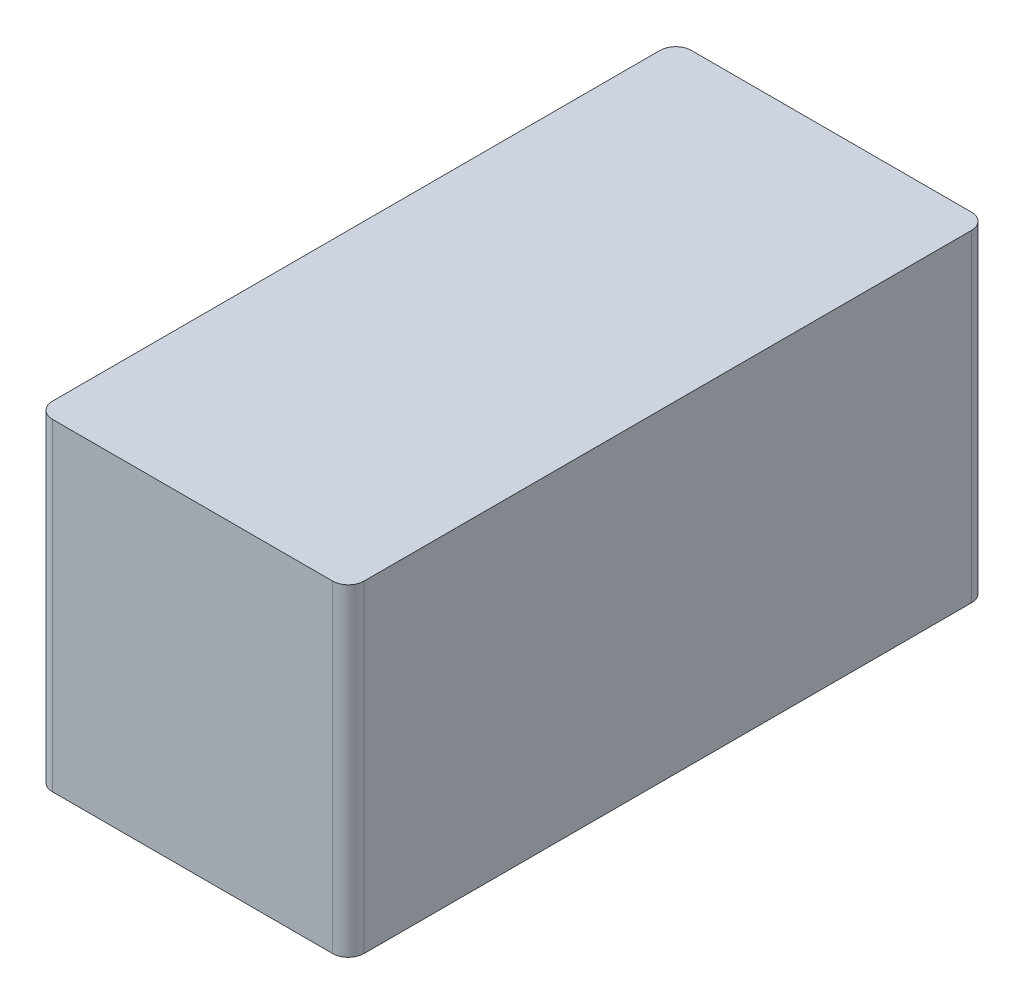
ISO-10303-21;
HEADER;
FILE_DESCRIPTION(('STEP AP214'),'2;1');
FILE_NAME('part.step','',(''),(''),'','','');
FILE_SCHEMA(('AUTOMOTIVE_DESIGN { 1 0 10303 214 1 1 1 1 }'));
ENDSEC;
DATA;
#1=APPLICATION_CONTEXT('core data for automotive mechanical design processes');
#2=APPLICATION_PROTOCOL_DEFINITION('international standard','automotive_design',2000,#1);
#3=PRODUCT_CONTEXT('',#1,'mechanical');
#4=PRODUCT('Part','Part','',(#3));
#5=PRODUCT_RELATED_PRODUCT_CATEGORY('part','',(#4));
#6=PRODUCT_DEFINITION_FORMATION('','',#4);
#7=PRODUCT_DEFINITION_CONTEXT('part definition',#1,'design');
#8=PRODUCT_DEFINITION('design','',#6,#7);
#9=PRODUCT_DEFINITION_SHAPE('','',#8);
#10=(LENGTH_UNIT() NAMED_UNIT(*) SI_UNIT(.MILLI.,.METRE.));
#11=(NAMED_UNIT(*) PLANE_ANGLE_UNIT() SI_UNIT($,.RADIAN.));
#12=(NAMED_UNIT(*) SI_UNIT($,.STERADIAN.) SOLID_ANGLE_UNIT());
#13=UNCERTAINTY_MEASURE_WITH_UNIT(LENGTH_MEASURE(1.E-05),#10,'distance_accuracy_value','');
#14=(GEOMETRIC_REPRESENTATION_CONTEXT(3) GLOBAL_UNCERTAINTY_ASSIGNED_CONTEXT((#13)) GLOBAL_UNIT_ASSIGNED_CONTEXT((#10,
#11,#12)) REPRESENTATION_CONTEXT('',''));
#15=CARTESIAN_POINT('',(0.,0.,0.));
#16=DIRECTION('',(0.,0.,1.));
#17=DIRECTION('',(1.,0.,0.));
#18=AXIS2_PLACEMENT_3D('',#15,#16,#17);
#19=CARTESIAN_POINT('',(9.9,10.25,-20.3));
#20=DIRECTION('',(-1.,0.,0.));
#21=DIRECTION('',(0.,0.,1.));
#22=AXIS2_PLACEMENT_3D('',#19,#20,#21);
#23=PLANE('',#22);
#24=DIRECTION('',(0.,0.,-1.));
#25=VECTOR('',#24,1.);
#26=CARTESIAN_POINT('',(9.9,-10.25,-20.3));
#27=LINE('',#26,#25);
#28=CARTESIAN_POINT('',(9.9,-10.25,19.3));
#29=VERTEX_POINT('',#28);
#30=CARTESIAN_POINT('',(9.9,-10.25,-19.3));
#31=VERTEX_POINT('',#30);
#32=EDGE_CURVE('E128',#29,#31,#27,.T.);
#33=ORIENTED_EDGE('',*,*,#32,.T.);
#34=DIRECTION('',(0.,-1.,0.));
#35=VECTOR('',#34,1.);
#36=CARTESIAN_POINT('',(9.9,10.25,-19.3));
#37=LINE('',#36,#35);
#38=CARTESIAN_POINT('',(9.9,10.25,-19.3));
#39=VERTEX_POINT('',#38);
#40=EDGE_CURVE('E151',#31,#39,#37,.F.);
#41=ORIENTED_EDGE('',*,*,#40,.T.);
#42=DIRECTION('',(0.,0.,-1.));
#43=VECTOR('',#42,1.);
#44=CARTESIAN_POINT('',(9.9,10.25,-20.3));
#45=LINE('',#44,#43);
#46=CARTESIAN_POINT('',(9.9,10.25,19.3));
#47=VERTEX_POINT('',#46);
#48=EDGE_CURVE('E126',#47,#39,#45,.T.);
#49=ORIENTED_EDGE('',*,*,#48,.F.);
#50=DIRECTION('',(0.,-1.,0.));
#51=VECTOR('',#50,1.);
#52=CARTESIAN_POINT('',(9.9,10.25,19.3));
#53=LINE('',#52,#51);
#54=EDGE_CURVE('E148',#47,#29,#53,.T.);
#55=ORIENTED_EDGE('',*,*,#54,.T.);
#56=EDGE_LOOP('',(#33,#41,#49,#55));
#57=FACE_BOUND('',#56,.T.);
#58=ADVANCED_FACE('F33',(#57),#23,.F.);
#59=CARTESIAN_POINT('',(-9.9,10.25,-20.3));
#60=DIRECTION('',(0.,0.,1.));
#61=DIRECTION('',(1.,0.,0.));
#62=AXIS2_PLACEMENT_3D('',#59,#60,#61);
#63=PLANE('',#62);
#64=DIRECTION('',(-1.,0.,0.));
#65=VECTOR('',#64,1.);
#66=CARTESIAN_POINT('',(-9.9,-10.25,-20.3));
#67=LINE('',#66,#65);
#68=CARTESIAN_POINT('',(8.9,-10.25,-20.3));
#69=VERTEX_POINT('',#68);
#70=CARTESIAN_POINT('',(-8.9,-10.25,-20.3));
#71=VERTEX_POINT('',#70);
#72=EDGE_CURVE('E124',#69,#71,#67,.T.);
#73=ORIENTED_EDGE('',*,*,#72,.T.);
#74=DIRECTION('',(0.,-1.,0.));
#75=VECTOR('',#74,1.);
#76=CARTESIAN_POINT('',(-8.9,10.25,-20.3));
#77=LINE('',#76,#75);
#78=CARTESIAN_POINT('',(-8.9,10.25,-20.3));
#79=VERTEX_POINT('',#78);
#80=EDGE_CURVE('E103',#71,#79,#77,.F.);
#81=ORIENTED_EDGE('',*,*,#80,.T.);
#82=DIRECTION('',(-1.,0.,0.));
#83=VECTOR('',#82,1.);
#84=CARTESIAN_POINT('',(-9.9,10.25,-20.3));
#85=LINE('',#84,#83);
#86=CARTESIAN_POINT('',(8.9,10.25,-20.3));
#87=VERTEX_POINT('',#86);
#88=EDGE_CURVE('E167',#87,#79,#85,.T.);
#89=ORIENTED_EDGE('',*,*,#88,.F.);
#90=DIRECTION('',(0.,-1.,0.));
#91=VECTOR('',#90,1.);
#92=CARTESIAN_POINT('',(8.9,10.25,-20.3));
#93=LINE('',#92,#91);
#94=EDGE_CURVE('E108',#87,#69,#93,.T.);
#95=ORIENTED_EDGE('',*,*,#94,.T.);
#96=EDGE_LOOP('',(#73,#81,#89,#95));
#97=FACE_BOUND('',#96,.T.);
#98=ADVANCED_FACE('F184',(#97),#63,.F.);
#99=CARTESIAN_POINT('',(-9.9,10.25,-20.3));
#100=DIRECTION('',(1.,0.,0.));
#101=DIRECTION('',(0.,0.,-1.));
#102=AXIS2_PLACEMENT_3D('',#99,#100,#101);
#103=PLANE('',#102);
#104=DIRECTION('',(0.,0.,1.));
#105=VECTOR('',#104,1.);
#106=CARTESIAN_POINT('',(-9.9,10.25,-20.3));
#107=LINE('',#106,#105);
#108=CARTESIAN_POINT('',(-9.9,10.25,-19.3));
#109=VERTEX_POINT('',#108);
#110=CARTESIAN_POINT('',(-9.9,10.25,19.3));
#111=VERTEX_POINT('',#110);
#112=EDGE_CURVE('E117',#109,#111,#107,.T.);
#113=ORIENTED_EDGE('',*,*,#112,.F.);
#114=DIRECTION('',(0.,-1.,0.));
#115=VECTOR('',#114,1.);
#116=CARTESIAN_POINT('',(-9.9,10.25,-19.3));
#117=LINE('',#116,#115);
#118=CARTESIAN_POINT('',(-9.9,-10.25,-19.3));
#119=VERTEX_POINT('',#118);
#120=EDGE_CURVE('E102',#109,#119,#117,.T.);
#121=ORIENTED_EDGE('',*,*,#120,.T.);
#122=DIRECTION('',(0.,0.,1.));
#123=VECTOR('',#122,1.);
#124=CARTESIAN_POINT('',(-9.9,-10.25,-20.3));
#125=LINE('',#124,#123);
#126=CARTESIAN_POINT('',(-9.9,-10.25,19.3));
#127=VERTEX_POINT('',#126);
#128=EDGE_CURVE('E115',#119,#127,#125,.T.);
#129=ORIENTED_EDGE('',*,*,#128,.T.);
#130=DIRECTION('',(0.,-1.,0.));
#131=VECTOR('',#130,1.);
#132=CARTESIAN_POINT('',(-9.9,10.25,19.3));
#133=LINE('',#132,#131);
#134=EDGE_CURVE('E119',#127,#111,#133,.F.);
#135=ORIENTED_EDGE('',*,*,#134,.T.);
#136=EDGE_LOOP('',(#113,#121,#129,#135));
#137=FACE_BOUND('',#136,.T.);
#138=ADVANCED_FACE('F114',(#137),#103,.F.);
#139=CARTESIAN_POINT('',(-9.9,10.25,20.3));
#140=DIRECTION('',(0.,0.,-1.));
#141=DIRECTION('',(-1.,0.,0.));
#142=AXIS2_PLACEMENT_3D('',#139,#140,#141);
#143=PLANE('',#142);
#144=DIRECTION('',(1.,0.,0.));
#145=VECTOR('',#144,1.);
#146=CARTESIAN_POINT('',(-9.9,-10.25,20.3));
#147=LINE('',#146,#145);
#148=CARTESIAN_POINT('',(-8.9,-10.25,20.3));
#149=VERTEX_POINT('',#148);
#150=CARTESIAN_POINT('',(8.90000000000001,-10.25,20.3));
#151=VERTEX_POINT('',#150);
#152=EDGE_CURVE('E123',#149,#151,#147,.T.);
#153=ORIENTED_EDGE('',*,*,#152,.T.);
#154=DIRECTION('',(0.,-1.,0.));
#155=VECTOR('',#154,1.);
#156=CARTESIAN_POINT('',(8.90000000000001,10.25,20.3));
#157=LINE('',#156,#155);
#158=CARTESIAN_POINT('',(8.90000000000001,10.25,20.3));
#159=VERTEX_POINT('',#158);
#160=EDGE_CURVE('E11',#151,#159,#157,.F.);
#161=ORIENTED_EDGE('',*,*,#160,.T.);
#162=DIRECTION('',(1.,0.,0.));
#163=VECTOR('',#162,1.);
#164=CARTESIAN_POINT('',(-9.9,10.25,20.3));
#165=LINE('',#164,#163);
#166=CARTESIAN_POINT('',(-8.9,10.25,20.3));
#167=VERTEX_POINT('',#166);
#168=EDGE_CURVE('E132',#167,#159,#165,.T.);
#169=ORIENTED_EDGE('',*,*,#168,.F.);
#170=DIRECTION('',(0.,-1.,0.));
#171=VECTOR('',#170,1.);
#172=CARTESIAN_POINT('',(-8.9,10.25,20.3));
#173=LINE('',#172,#171);
#174=EDGE_CURVE('E41',#167,#149,#173,.T.);
#175=ORIENTED_EDGE('',*,*,#174,.T.);
#176=EDGE_LOOP('',(#153,#161,#169,#175));
#177=FACE_BOUND('',#176,.T.);
#178=ADVANCED_FACE('F154',(#177),#143,.F.);
#179=CARTESIAN_POINT('',(0.,10.25,0.));
#180=DIRECTION('',(0.,1.,0.));
#181=DIRECTION('',(0.,0.,1.));
#182=AXIS2_PLACEMENT_3D('',#179,#180,#181);
#183=PLANE('',#182);
#184=ORIENTED_EDGE('',*,*,#88,.T.);
#185=CARTESIAN_POINT('',(-8.9,10.25,-19.3));
#186=DIRECTION('',(0.,1.,0.));
#187=DIRECTION('',(0.,0.,1.));
#188=AXIS2_PLACEMENT_3D('',#185,#186,#187);
#189=CIRCLE('',#188,1.);
#190=EDGE_CURVE('E146',#79,#109,#189,.T.);
#191=ORIENTED_EDGE('',*,*,#190,.T.);
#192=ORIENTED_EDGE('',*,*,#112,.T.);
#193=CARTESIAN_POINT('',(-8.9,10.25,19.3));
#194=DIRECTION('',(0.,1.,0.));
#195=DIRECTION('',(0.,0.,1.));
#196=AXIS2_PLACEMENT_3D('',#193,#194,#195);
#197=CIRCLE('',#196,1.);
#198=EDGE_CURVE('E53',#111,#167,#197,.T.);
#199=ORIENTED_EDGE('',*,*,#198,.T.);
#200=ORIENTED_EDGE('',*,*,#168,.T.);
#201=CARTESIAN_POINT('',(8.90000000000001,10.25,19.3));
#202=DIRECTION('',(0.,1.,0.));
#203=DIRECTION('',(0.,0.,1.));
#204=AXIS2_PLACEMENT_3D('',#201,#202,#203);
#205=CIRCLE('',#204,1.);
#206=EDGE_CURVE('E142',#159,#47,#205,.T.);
#207=ORIENTED_EDGE('',*,*,#206,.T.);
#208=ORIENTED_EDGE('',*,*,#48,.T.);
#209=CARTESIAN_POINT('',(8.9,10.25,-19.3));
#210=DIRECTION('',(0.,1.,0.));
#211=DIRECTION('',(0.,0.,1.));
#212=AXIS2_PLACEMENT_3D('',#209,#210,#211);
#213=CIRCLE('',#212,1.);
#214=EDGE_CURVE('E144',#39,#87,#213,.T.);
#215=ORIENTED_EDGE('',*,*,#214,.T.);
#216=EDGE_LOOP('',(#184,#191,#192,#199,#200,#207,#208,#215));
#217=FACE_BOUND('',#216,.T.);
#218=ADVANCED_FACE('F173',(#217),#183,.T.);
#219=CARTESIAN_POINT('',(0.,-10.25,0.));
#220=DIRECTION('',(0.,1.,0.));
#221=DIRECTION('',(0.,0.,1.));
#222=AXIS2_PLACEMENT_3D('',#219,#220,#221);
#223=PLANE('',#222);
#224=ORIENTED_EDGE('',*,*,#128,.F.);
#225=CARTESIAN_POINT('',(-8.9,-10.25,-19.3));
#226=DIRECTION('',(0.,1.,0.));
#227=DIRECTION('',(0.,0.,1.));
#228=AXIS2_PLACEMENT_3D('',#225,#226,#227);
#229=CIRCLE('',#228,1.);
#230=EDGE_CURVE('E98',#119,#71,#229,.F.);
#231=ORIENTED_EDGE('',*,*,#230,.T.);
#232=ORIENTED_EDGE('',*,*,#72,.F.);
#233=CARTESIAN_POINT('',(8.9,-10.25,-19.3));
#234=DIRECTION('',(0.,1.,0.));
#235=DIRECTION('',(0.,0.,1.));
#236=AXIS2_PLACEMENT_3D('',#233,#234,#235);
#237=CIRCLE('',#236,1.);
#238=EDGE_CURVE('E109',#69,#31,#237,.F.);
#239=ORIENTED_EDGE('',*,*,#238,.T.);
#240=ORIENTED_EDGE('',*,*,#32,.F.);
#241=CARTESIAN_POINT('',(8.90000000000001,-10.25,19.3));
#242=DIRECTION('',(0.,1.,0.));
#243=DIRECTION('',(0.,0.,1.));
#244=AXIS2_PLACEMENT_3D('',#241,#242,#243);
#245=CIRCLE('',#244,1.);
#246=EDGE_CURVE('E135',#29,#151,#245,.F.);
#247=ORIENTED_EDGE('',*,*,#246,.T.);
#248=ORIENTED_EDGE('',*,*,#152,.F.);
#249=CARTESIAN_POINT('',(-8.9,-10.25,19.3));
#250=DIRECTION('',(0.,1.,0.));
#251=DIRECTION('',(0.,0.,1.));
#252=AXIS2_PLACEMENT_3D('',#249,#250,#251);
#253=CIRCLE('',#252,1.);
#254=EDGE_CURVE('E118',#149,#127,#253,.F.);
#255=ORIENTED_EDGE('',*,*,#254,.T.);
#256=EDGE_LOOP('',(#224,#231,#232,#239,#240,#247,#248,#255));
#257=FACE_BOUND('',#256,.T.);
#258=ADVANCED_FACE('F121',(#257),#223,.F.);
#259=CARTESIAN_POINT('',(-8.9,10.25,-19.3));
#260=DIRECTION('',(0.,-1.,0.));
#261=DIRECTION('',(0.,0.,-1.));
#262=AXIS2_PLACEMENT_3D('',#259,#260,#261);
#263=CYLINDRICAL_SURFACE('',#262,1.);
#264=ORIENTED_EDGE('',*,*,#190,.F.);
#265=ORIENTED_EDGE('',*,*,#80,.F.);
#266=ORIENTED_EDGE('',*,*,#230,.F.);
#267=ORIENTED_EDGE('',*,*,#120,.F.);
#268=EDGE_LOOP('',(#264,#265,#266,#267));
#269=FACE_BOUND('',#268,.T.);
#270=ADVANCED_FACE('F101',(#269),#263,.T.);
#271=CARTESIAN_POINT('',(8.9,10.25,-19.3));
#272=DIRECTION('',(0.,-1.,0.));
#273=DIRECTION('',(0.,0.,-1.));
#274=AXIS2_PLACEMENT_3D('',#271,#272,#273);
#275=CYLINDRICAL_SURFACE('',#274,1.);
#276=ORIENTED_EDGE('',*,*,#214,.F.);
#277=ORIENTED_EDGE('',*,*,#40,.F.);
#278=ORIENTED_EDGE('',*,*,#238,.F.);
#279=ORIENTED_EDGE('',*,*,#94,.F.);
#280=EDGE_LOOP('',(#276,#277,#278,#279));
#281=FACE_BOUND('',#280,.T.);
#282=ADVANCED_FACE('F195',(#281),#275,.T.);
#283=CARTESIAN_POINT('',(8.90000000000001,10.25,19.3));
#284=DIRECTION('',(0.,-1.,0.));
#285=DIRECTION('',(0.,0.,-1.));
#286=AXIS2_PLACEMENT_3D('',#283,#284,#285);
#287=CYLINDRICAL_SURFACE('',#286,1.);
#288=ORIENTED_EDGE('',*,*,#206,.F.);
#289=ORIENTED_EDGE('',*,*,#160,.F.);
#290=ORIENTED_EDGE('',*,*,#246,.F.);
#291=ORIENTED_EDGE('',*,*,#54,.F.);
#292=EDGE_LOOP('',(#288,#289,#290,#291));
#293=FACE_BOUND('',#292,.T.);
#294=ADVANCED_FACE('F161',(#293),#287,.T.);
#295=CARTESIAN_POINT('',(-8.9,10.25,19.3));
#296=DIRECTION('',(0.,-1.,0.));
#297=DIRECTION('',(0.,0.,-1.));
#298=AXIS2_PLACEMENT_3D('',#295,#296,#297);
#299=CYLINDRICAL_SURFACE('',#298,1.);
#300=ORIENTED_EDGE('',*,*,#198,.F.);
#301=ORIENTED_EDGE('',*,*,#134,.F.);
#302=ORIENTED_EDGE('',*,*,#254,.F.);
#303=ORIENTED_EDGE('',*,*,#174,.F.);
#304=EDGE_LOOP('',(#300,#301,#302,#303));
#305=FACE_BOUND('',#304,.T.);
#306=ADVANCED_FACE('F35',(#305),#299,.T.);
#307=CLOSED_SHELL('',(#58,#98,#138,#178,#218,#258,#270,#282,#294,#306));
#308=MANIFOLD_SOLID_BREP('B2',#307);
#309=ADVANCED_BREP_SHAPE_REPRESENTATION('',(#18,#308),#14);
#310=SHAPE_DEFINITION_REPRESENTATION(#9,#309);
ENDSEC;
END-ISO-10303-21;
